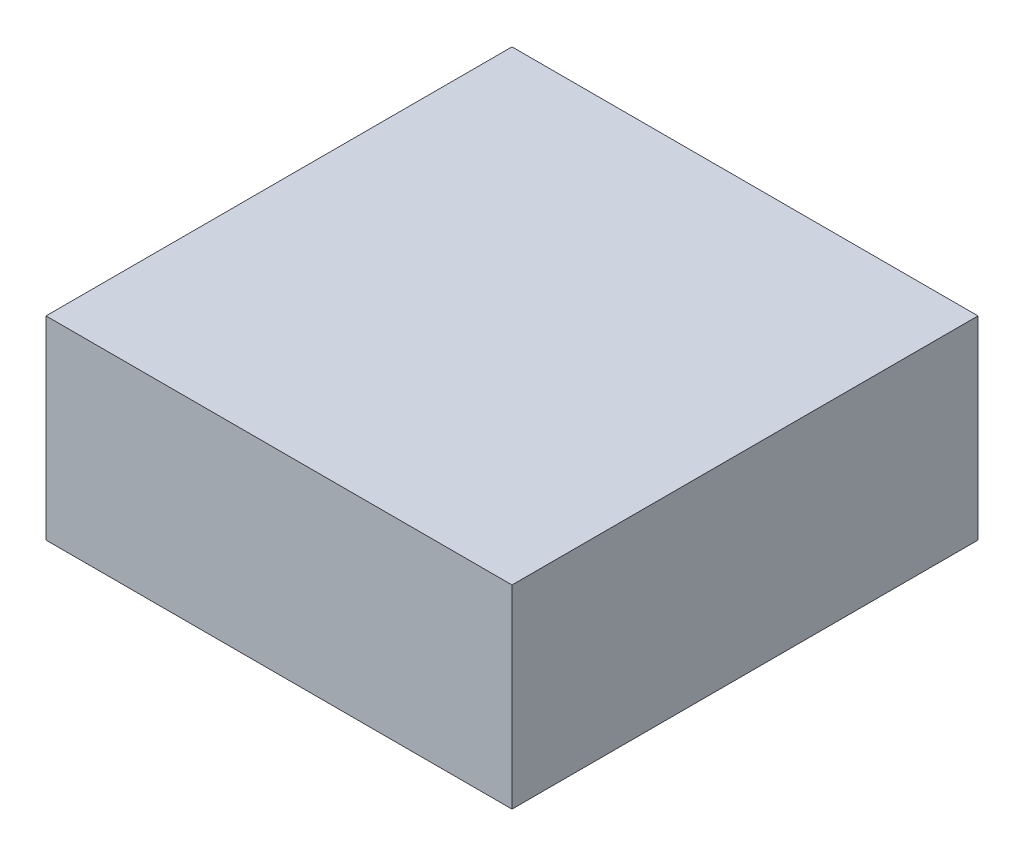
ISO-10303-21;
HEADER;
FILE_DESCRIPTION(('STEP AP214'),'2;1');
FILE_NAME('part.step','',(''),(''),'','','');
FILE_SCHEMA(('AUTOMOTIVE_DESIGN { 1 0 10303 214 1 1 1 1 }'));
ENDSEC;
DATA;
#1=APPLICATION_CONTEXT('core data for automotive mechanical design processes');
#2=APPLICATION_PROTOCOL_DEFINITION('international standard','automotive_design',2000,#1);
#3=PRODUCT_CONTEXT('',#1,'mechanical');
#4=PRODUCT('Part','Part','',(#3));
#5=PRODUCT_RELATED_PRODUCT_CATEGORY('part','',(#4));
#6=PRODUCT_DEFINITION_FORMATION('','',#4);
#7=PRODUCT_DEFINITION_CONTEXT('part definition',#1,'design');
#8=PRODUCT_DEFINITION('design','',#6,#7);
#9=PRODUCT_DEFINITION_SHAPE('','',#8);
#10=(LENGTH_UNIT() NAMED_UNIT(*) SI_UNIT(.MILLI.,.METRE.));
#11=(NAMED_UNIT(*) PLANE_ANGLE_UNIT() SI_UNIT($,.RADIAN.));
#12=(NAMED_UNIT(*) SI_UNIT($,.STERADIAN.) SOLID_ANGLE_UNIT());
#13=UNCERTAINTY_MEASURE_WITH_UNIT(LENGTH_MEASURE(1.E-05),#10,'distance_accuracy_value','');
#14=(GEOMETRIC_REPRESENTATION_CONTEXT(3) GLOBAL_UNCERTAINTY_ASSIGNED_CONTEXT((#13)) GLOBAL_UNIT_ASSIGNED_CONTEXT((#10,
#11,#12)) REPRESENTATION_CONTEXT('',''));
#15=CARTESIAN_POINT('',(0.,0.,0.));
#16=DIRECTION('',(0.,0.,1.));
#17=DIRECTION('',(1.,0.,0.));
#18=AXIS2_PLACEMENT_3D('',#15,#16,#17);
#19=CARTESIAN_POINT('',(0.,1.21,0.));
#20=DIRECTION('',(0.,-1.,0.));
#21=DIRECTION('',(0.,0.,-1.));
#22=AXIS2_PLACEMENT_3D('',#19,#20,#21);
#23=PLANE('',#22);
#24=DIRECTION('',(1.,0.,0.));
#25=VECTOR('',#24,1.);
#26=CARTESIAN_POINT('',(0.,1.21,0.24));
#27=LINE('',#26,#25);
#28=CARTESIAN_POINT('',(0.24,1.21,0.24));
#29=VERTEX_POINT('',#28);
#30=CARTESIAN_POINT('',(-0.24,1.21,0.24));
#31=VERTEX_POINT('',#30);
#32=EDGE_CURVE('E53',#29,#31,#27,.F.);
#33=ORIENTED_EDGE('',*,*,#32,.F.);
#34=DIRECTION('',(0.,0.,1.));
#35=VECTOR('',#34,1.);
#36=CARTESIAN_POINT('',(0.24,1.21,0.));
#37=LINE('',#36,#35);
#38=CARTESIAN_POINT('',(0.24,1.21,-0.24));
#39=VERTEX_POINT('',#38);
#40=EDGE_CURVE('E61',#29,#39,#37,.F.);
#41=ORIENTED_EDGE('',*,*,#40,.T.);
#42=DIRECTION('',(1.,0.,0.));
#43=VECTOR('',#42,1.);
#44=CARTESIAN_POINT('',(0.,1.21,-0.24));
#45=LINE('',#44,#43);
#46=CARTESIAN_POINT('',(-0.24,1.21,-0.24));
#47=VERTEX_POINT('',#46);
#48=EDGE_CURVE('E20',#39,#47,#45,.F.);
#49=ORIENTED_EDGE('',*,*,#48,.T.);
#50=DIRECTION('',(0.,0.,-1.));
#51=VECTOR('',#50,1.);
#52=CARTESIAN_POINT('',(-0.24,1.21,0.));
#53=LINE('',#52,#51);
#54=EDGE_CURVE('E59',#47,#31,#53,.F.);
#55=ORIENTED_EDGE('',*,*,#54,.T.);
#56=EDGE_LOOP('',(#33,#41,#49,#55));
#57=FACE_BOUND('',#56,.T.);
#58=ADVANCED_FACE('F17',(#57),#23,.F.);
#59=CARTESIAN_POINT('',(0.,1.11,-0.24));
#60=DIRECTION('',(0.,0.,1.));
#61=DIRECTION('',(1.,0.,0.));
#62=AXIS2_PLACEMENT_3D('',#59,#60,#61);
#63=PLANE('',#62);
#64=ORIENTED_EDGE('',*,*,#48,.F.);
#65=DIRECTION('',(0.,1.,0.));
#66=VECTOR('',#65,1.);
#67=CARTESIAN_POINT('',(0.24,1.11,-0.24));
#68=LINE('',#67,#66);
#69=CARTESIAN_POINT('',(0.24,1.01,-0.24));
#70=VERTEX_POINT('',#69);
#71=EDGE_CURVE('E79',#39,#70,#68,.F.);
#72=ORIENTED_EDGE('',*,*,#71,.T.);
#73=DIRECTION('',(1.,0.,0.));
#74=VECTOR('',#73,1.);
#75=CARTESIAN_POINT('',(0.,1.01,-0.24));
#76=LINE('',#75,#74);
#77=CARTESIAN_POINT('',(-0.24,1.01,-0.24));
#78=VERTEX_POINT('',#77);
#79=EDGE_CURVE('E75',#70,#78,#76,.F.);
#80=ORIENTED_EDGE('',*,*,#79,.T.);
#81=DIRECTION('',(0.,1.,0.));
#82=VECTOR('',#81,1.);
#83=CARTESIAN_POINT('',(-0.24,1.11,-0.24));
#84=LINE('',#83,#82);
#85=EDGE_CURVE('E66',#78,#47,#84,.T.);
#86=ORIENTED_EDGE('',*,*,#85,.T.);
#87=EDGE_LOOP('',(#64,#72,#80,#86));
#88=FACE_BOUND('',#87,.T.);
#89=ADVANCED_FACE('F74',(#88),#63,.F.);
#90=CARTESIAN_POINT('',(-0.24,1.11,0.));
#91=DIRECTION('',(1.,0.,0.));
#92=DIRECTION('',(0.,0.,-1.));
#93=AXIS2_PLACEMENT_3D('',#90,#91,#92);
#94=PLANE('',#93);
#95=DIRECTION('',(0.,1.,0.));
#96=VECTOR('',#95,1.);
#97=CARTESIAN_POINT('',(-0.24,1.11,0.24));
#98=LINE('',#97,#96);
#99=CARTESIAN_POINT('',(-0.24,1.01,0.24));
#100=VERTEX_POINT('',#99);
#101=EDGE_CURVE('E71',#31,#100,#98,.F.);
#102=ORIENTED_EDGE('',*,*,#101,.F.);
#103=ORIENTED_EDGE('',*,*,#54,.F.);
#104=ORIENTED_EDGE('',*,*,#85,.F.);
#105=DIRECTION('',(0.,0.,1.));
#106=VECTOR('',#105,1.);
#107=CARTESIAN_POINT('',(-0.24,1.01,0.));
#108=LINE('',#107,#106);
#109=EDGE_CURVE('E84',#78,#100,#108,.T.);
#110=ORIENTED_EDGE('',*,*,#109,.T.);
#111=EDGE_LOOP('',(#102,#103,#104,#110));
#112=FACE_BOUND('',#111,.T.);
#113=ADVANCED_FACE('F68',(#112),#94,.F.);
#114=CARTESIAN_POINT('',(0.,1.11,0.24));
#115=DIRECTION('',(0.,0.,1.));
#116=DIRECTION('',(1.,0.,0.));
#117=AXIS2_PLACEMENT_3D('',#114,#115,#116);
#118=PLANE('',#117);
#119=ORIENTED_EDGE('',*,*,#101,.T.);
#120=DIRECTION('',(1.,0.,0.));
#121=VECTOR('',#120,1.);
#122=CARTESIAN_POINT('',(0.,1.01,0.24));
#123=LINE('',#122,#121);
#124=CARTESIAN_POINT('',(0.24,1.01,0.24));
#125=VERTEX_POINT('',#124);
#126=EDGE_CURVE('E26',#100,#125,#123,.T.);
#127=ORIENTED_EDGE('',*,*,#126,.T.);
#128=DIRECTION('',(0.,1.,0.));
#129=VECTOR('',#128,1.);
#130=CARTESIAN_POINT('',(0.24,1.11,0.24));
#131=LINE('',#130,#129);
#132=EDGE_CURVE('E34',#125,#29,#131,.T.);
#133=ORIENTED_EDGE('',*,*,#132,.T.);
#134=ORIENTED_EDGE('',*,*,#32,.T.);
#135=EDGE_LOOP('',(#119,#127,#133,#134));
#136=FACE_BOUND('',#135,.T.);
#137=ADVANCED_FACE('F88',(#136),#118,.T.);
#138=CARTESIAN_POINT('',(0.24,1.11,0.));
#139=DIRECTION('',(-1.,0.,0.));
#140=DIRECTION('',(0.,0.,1.));
#141=AXIS2_PLACEMENT_3D('',#138,#139,#140);
#142=PLANE('',#141);
#143=ORIENTED_EDGE('',*,*,#132,.F.);
#144=DIRECTION('',(0.,0.,1.));
#145=VECTOR('',#144,1.);
#146=CARTESIAN_POINT('',(0.24,1.01,0.));
#147=LINE('',#146,#145);
#148=EDGE_CURVE('E11',#125,#70,#147,.F.);
#149=ORIENTED_EDGE('',*,*,#148,.T.);
#150=ORIENTED_EDGE('',*,*,#71,.F.);
#151=ORIENTED_EDGE('',*,*,#40,.F.);
#152=EDGE_LOOP('',(#143,#149,#150,#151));
#153=FACE_BOUND('',#152,.T.);
#154=ADVANCED_FACE('F91',(#153),#142,.F.);
#155=CARTESIAN_POINT('',(0.,1.01,0.));
#156=DIRECTION('',(0.,1.,0.));
#157=DIRECTION('',(0.,0.,1.));
#158=AXIS2_PLACEMENT_3D('',#155,#156,#157);
#159=PLANE('',#158);
#160=ORIENTED_EDGE('',*,*,#126,.F.);
#161=ORIENTED_EDGE('',*,*,#109,.F.);
#162=ORIENTED_EDGE('',*,*,#79,.F.);
#163=ORIENTED_EDGE('',*,*,#148,.F.);
#164=EDGE_LOOP('',(#160,#161,#162,#163));
#165=FACE_BOUND('',#164,.T.);
#166=ADVANCED_FACE('F90',(#165),#159,.F.);
#167=CLOSED_SHELL('',(#58,#89,#113,#137,#154,#166));
#168=MANIFOLD_SOLID_BREP('B1',#167);
#169=ADVANCED_BREP_SHAPE_REPRESENTATION('',(#18,#168),#14);
#170=SHAPE_DEFINITION_REPRESENTATION(#9,#169);
ENDSEC;
END-ISO-10303-21;
